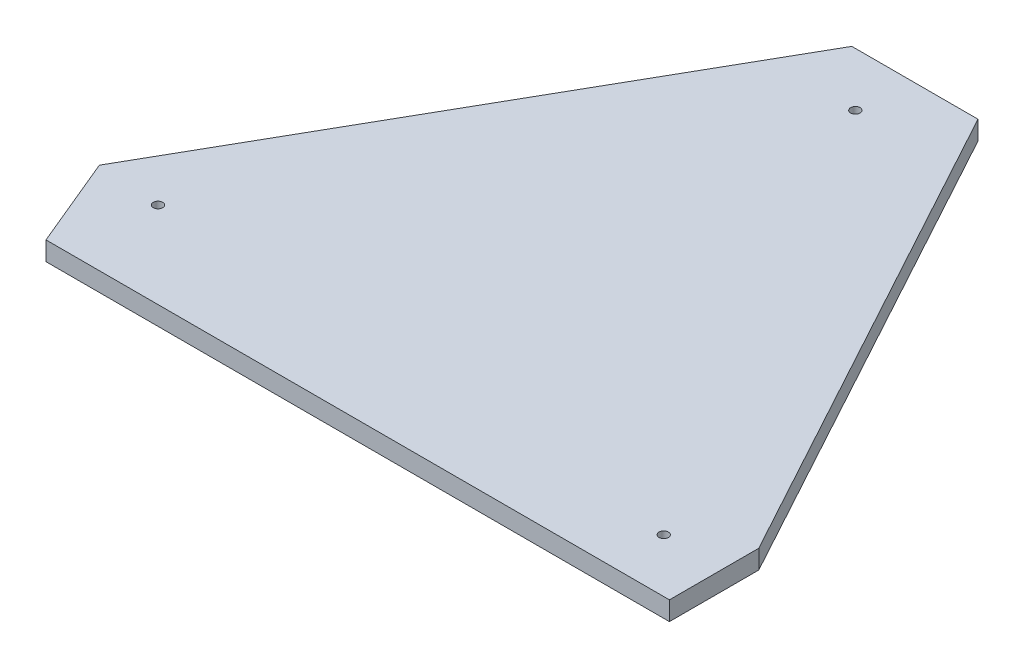
ISO-10303-21;
HEADER;
FILE_DESCRIPTION(('STEP AP214'),'2;1');
FILE_NAME('part.step','',(''),(''),'','','');
FILE_SCHEMA(('AUTOMOTIVE_DESIGN { 1 0 10303 214 1 1 1 1 }'));
ENDSEC;
DATA;
#1=APPLICATION_CONTEXT('core data for automotive mechanical design processes');
#2=APPLICATION_PROTOCOL_DEFINITION('international standard','automotive_design',2000,#1);
#3=PRODUCT_CONTEXT('',#1,'mechanical');
#4=PRODUCT('Part','Part','',(#3));
#5=PRODUCT_RELATED_PRODUCT_CATEGORY('part','',(#4));
#6=PRODUCT_DEFINITION_FORMATION('','',#4);
#7=PRODUCT_DEFINITION_CONTEXT('part definition',#1,'design');
#8=PRODUCT_DEFINITION('design','',#6,#7);
#9=PRODUCT_DEFINITION_SHAPE('','',#8);
#10=(LENGTH_UNIT() NAMED_UNIT(*) SI_UNIT(.MILLI.,.METRE.));
#11=(NAMED_UNIT(*) PLANE_ANGLE_UNIT() SI_UNIT($,.RADIAN.));
#12=(NAMED_UNIT(*) SI_UNIT($,.STERADIAN.) SOLID_ANGLE_UNIT());
#13=UNCERTAINTY_MEASURE_WITH_UNIT(LENGTH_MEASURE(1.E-05),#10,'distance_accuracy_value','');
#14=(GEOMETRIC_REPRESENTATION_CONTEXT(3) GLOBAL_UNCERTAINTY_ASSIGNED_CONTEXT((#13)) GLOBAL_UNIT_ASSIGNED_CONTEXT((#10,
#11,#12)) REPRESENTATION_CONTEXT('',''));
#15=CARTESIAN_POINT('',(0.,0.,0.));
#16=DIRECTION('',(0.,0.,1.));
#17=DIRECTION('',(1.,0.,0.));
#18=AXIS2_PLACEMENT_3D('',#15,#16,#17);
#19=CARTESIAN_POINT('',(0.,15.875,-75.0824));
#20=DIRECTION('',(-1.,0.,0.));
#21=DIRECTION('',(0.,0.,1.));
#22=AXIS2_PLACEMENT_3D('',#19,#20,#21);
#23=PLANE('',#22);
#24=DIRECTION('',(0.,0.,-1.));
#25=VECTOR('',#24,1.);
#26=CARTESIAN_POINT('',(0.,0.,-75.0824));
#27=LINE('',#26,#25);
#28=CARTESIAN_POINT('',(0.,0.,0.));
#29=VERTEX_POINT('',#28);
#30=CARTESIAN_POINT('',(0.,0.,-75.0824));
#31=VERTEX_POINT('',#30);
#32=EDGE_CURVE('E127',#29,#31,#27,.T.);
#33=ORIENTED_EDGE('',*,*,#32,.T.);
#34=DIRECTION('',(0.,-1.,0.));
#35=VECTOR('',#34,1.);
#36=CARTESIAN_POINT('',(0.,15.875,-75.0824));
#37=LINE('',#36,#35);
#38=CARTESIAN_POINT('',(0.,15.875,-75.0824));
#39=VERTEX_POINT('',#38);
#40=EDGE_CURVE('E11',#39,#31,#37,.T.);
#41=ORIENTED_EDGE('',*,*,#40,.F.);
#42=DIRECTION('',(0.,0.,-1.));
#43=VECTOR('',#42,1.);
#44=CARTESIAN_POINT('',(0.,15.875,-75.0824));
#45=LINE('',#44,#43);
#46=CARTESIAN_POINT('',(0.,15.875,0.));
#47=VERTEX_POINT('',#46);
#48=EDGE_CURVE('E144',#47,#39,#45,.T.);
#49=ORIENTED_EDGE('',*,*,#48,.F.);
#50=DIRECTION('',(0.,-1.,0.));
#51=VECTOR('',#50,1.);
#52=CARTESIAN_POINT('',(0.,15.875,0.));
#53=LINE('',#52,#51);
#54=EDGE_CURVE('E123',#47,#29,#53,.T.);
#55=ORIENTED_EDGE('',*,*,#54,.T.);
#56=EDGE_LOOP('',(#33,#41,#49,#55));
#57=FACE_BOUND('',#56,.T.);
#58=ADVANCED_FACE('F38',(#57),#23,.F.);
#59=CARTESIAN_POINT('',(-220.118609958904,15.875,-479.425));
#60=DIRECTION('',(-0.878289655172414,0.,0.478128938276196));
#61=DIRECTION('',(0.478128938276196,0.,0.878289655172414));
#62=AXIS2_PLACEMENT_3D('',#59,#60,#61);
#63=PLANE('',#62);
#64=DIRECTION('',(-0.478128938276196,0.,-0.878289655172414));
#65=VECTOR('',#64,1.);
#66=CARTESIAN_POINT('',(-220.118609958904,0.,-479.425));
#67=LINE('',#66,#65);
#68=CARTESIAN_POINT('',(-220.118609958904,0.,-479.425));
#69=VERTEX_POINT('',#68);
#70=EDGE_CURVE('E131',#31,#69,#67,.T.);
#71=ORIENTED_EDGE('',*,*,#70,.T.);
#72=DIRECTION('',(0.,-1.,0.));
#73=VECTOR('',#72,1.);
#74=CARTESIAN_POINT('',(-220.118609958904,15.875,-479.425));
#75=LINE('',#74,#73);
#76=CARTESIAN_POINT('',(-220.118609958904,15.875,-479.425));
#77=VERTEX_POINT('',#76);
#78=EDGE_CURVE('E47',#77,#69,#75,.T.);
#79=ORIENTED_EDGE('',*,*,#78,.F.);
#80=DIRECTION('',(-0.478128938276196,0.,-0.878289655172414));
#81=VECTOR('',#80,1.);
#82=CARTESIAN_POINT('',(-220.118609958904,15.875,-479.425));
#83=LINE('',#82,#81);
#84=EDGE_CURVE('E92',#39,#77,#83,.T.);
#85=ORIENTED_EDGE('',*,*,#84,.F.);
#86=ORIENTED_EDGE('',*,*,#40,.T.);
#87=EDGE_LOOP('',(#71,#79,#85,#86));
#88=FACE_BOUND('',#87,.T.);
#89=ADVANCED_FACE('F174',(#88),#63,.F.);
#90=CARTESIAN_POINT('',(-326.138209958904,15.875,-479.425));
#91=DIRECTION('',(0.,0.,1.));
#92=DIRECTION('',(1.,0.,0.));
#93=AXIS2_PLACEMENT_3D('',#90,#91,#92);
#94=PLANE('',#93);
#95=DIRECTION('',(-1.,0.,0.));
#96=VECTOR('',#95,1.);
#97=CARTESIAN_POINT('',(-326.138209958904,0.,-479.425));
#98=LINE('',#97,#96);
#99=CARTESIAN_POINT('',(-326.138209958904,0.,-479.425));
#100=VERTEX_POINT('',#99);
#101=EDGE_CURVE('E135',#69,#100,#98,.T.);
#102=ORIENTED_EDGE('',*,*,#101,.T.);
#103=DIRECTION('',(0.,-1.,0.));
#104=VECTOR('',#103,1.);
#105=CARTESIAN_POINT('',(-326.138209958904,15.875,-479.425));
#106=LINE('',#105,#104);
#107=CARTESIAN_POINT('',(-326.138209958904,15.875,-479.425));
#108=VERTEX_POINT('',#107);
#109=EDGE_CURVE('E116',#108,#100,#106,.T.);
#110=ORIENTED_EDGE('',*,*,#109,.F.);
#111=DIRECTION('',(-1.,0.,0.));
#112=VECTOR('',#111,1.);
#113=CARTESIAN_POINT('',(-326.138209958904,15.875,-479.425));
#114=LINE('',#113,#112);
#115=EDGE_CURVE('E105',#77,#108,#114,.T.);
#116=ORIENTED_EDGE('',*,*,#115,.F.);
#117=ORIENTED_EDGE('',*,*,#78,.T.);
#118=EDGE_LOOP('',(#102,#110,#116,#117));
#119=FACE_BOUND('',#118,.T.);
#120=ADVANCED_FACE('F154',(#119),#94,.F.);
#121=CARTESIAN_POINT('',(-555.849378123616,15.875,-76.7944227701986));
#122=DIRECTION('',(0.868580686505882,0.,0.495547768665112));
#123=DIRECTION('',(0.495547768665112,0.,-0.868580686505882));
#124=AXIS2_PLACEMENT_3D('',#121,#122,#123);
#125=PLANE('',#124);
#126=DIRECTION('',(-0.495547768665112,0.,0.868580686505882));
#127=VECTOR('',#126,1.);
#128=CARTESIAN_POINT('',(-555.849378123616,0.,-76.7944227701986));
#129=LINE('',#128,#127);
#130=CARTESIAN_POINT('',(-555.849378123616,0.,-76.7944227701986));
#131=VERTEX_POINT('',#130);
#132=EDGE_CURVE('E114',#100,#131,#129,.T.);
#133=ORIENTED_EDGE('',*,*,#132,.T.);
#134=DIRECTION('',(0.,-1.,0.));
#135=VECTOR('',#134,1.);
#136=CARTESIAN_POINT('',(-555.849378123616,15.875,-76.7944227701986));
#137=LINE('',#136,#135);
#138=CARTESIAN_POINT('',(-555.849378123616,15.875,-76.7944227701986));
#139=VERTEX_POINT('',#138);
#140=EDGE_CURVE('E111',#139,#131,#137,.T.);
#141=ORIENTED_EDGE('',*,*,#140,.F.);
#142=DIRECTION('',(-0.495547768665112,0.,0.868580686505882));
#143=VECTOR('',#142,1.);
#144=CARTESIAN_POINT('',(-555.849378123616,15.875,-76.7944227701986));
#145=LINE('',#144,#143);
#146=EDGE_CURVE('E99',#108,#139,#145,.T.);
#147=ORIENTED_EDGE('',*,*,#146,.F.);
#148=ORIENTED_EDGE('',*,*,#109,.T.);
#149=EDGE_LOOP('',(#133,#141,#147,#148));
#150=FACE_BOUND('',#149,.T.);
#151=ADVANCED_FACE('F112',(#150),#125,.F.);
#152=CARTESIAN_POINT('',(-523.875,15.875,0.));
#153=DIRECTION('',(0.92317632710463,0.,-0.384376728059342));
#154=DIRECTION('',(-0.384376728059342,0.,-0.92317632710463));
#155=AXIS2_PLACEMENT_3D('',#152,#153,#154);
#156=PLANE('',#155);
#157=DIRECTION('',(0.384376728059342,0.,0.92317632710463));
#158=VECTOR('',#157,1.);
#159=CARTESIAN_POINT('',(-523.875,0.,0.));
#160=LINE('',#159,#158);
#161=CARTESIAN_POINT('',(-523.875,0.,0.));
#162=VERTEX_POINT('',#161);
#163=EDGE_CURVE('E78',#131,#162,#160,.T.);
#164=ORIENTED_EDGE('',*,*,#163,.T.);
#165=DIRECTION('',(0.,-1.,0.));
#166=VECTOR('',#165,1.);
#167=CARTESIAN_POINT('',(-523.875,15.875,0.));
#168=LINE('',#167,#166);
#169=CARTESIAN_POINT('',(-523.875,15.875,0.));
#170=VERTEX_POINT('',#169);
#171=EDGE_CURVE('E117',#170,#162,#168,.T.);
#172=ORIENTED_EDGE('',*,*,#171,.F.);
#173=DIRECTION('',(0.384376728059342,0.,0.92317632710463));
#174=VECTOR('',#173,1.);
#175=CARTESIAN_POINT('',(-523.875,15.875,0.));
#176=LINE('',#175,#174);
#177=EDGE_CURVE('E103',#139,#170,#176,.T.);
#178=ORIENTED_EDGE('',*,*,#177,.F.);
#179=ORIENTED_EDGE('',*,*,#140,.T.);
#180=EDGE_LOOP('',(#164,#172,#178,#179));
#181=FACE_BOUND('',#180,.T.);
#182=ADVANCED_FACE('F119',(#181),#156,.F.);
#183=CARTESIAN_POINT('',(0.,15.875,0.));
#184=DIRECTION('',(0.,0.,-1.));
#185=DIRECTION('',(-1.,0.,0.));
#186=AXIS2_PLACEMENT_3D('',#183,#184,#185);
#187=PLANE('',#186);
#188=DIRECTION('',(1.,0.,0.));
#189=VECTOR('',#188,1.);
#190=CARTESIAN_POINT('',(0.,0.,0.));
#191=LINE('',#190,#189);
#192=EDGE_CURVE('E84',#162,#29,#191,.T.);
#193=ORIENTED_EDGE('',*,*,#192,.T.);
#194=ORIENTED_EDGE('',*,*,#54,.F.);
#195=DIRECTION('',(1.,0.,0.));
#196=VECTOR('',#195,1.);
#197=CARTESIAN_POINT('',(0.,15.875,0.));
#198=LINE('',#197,#196);
#199=EDGE_CURVE('E55',#170,#47,#198,.T.);
#200=ORIENTED_EDGE('',*,*,#199,.F.);
#201=ORIENTED_EDGE('',*,*,#171,.T.);
#202=EDGE_LOOP('',(#193,#194,#200,#201));
#203=FACE_BOUND('',#202,.T.);
#204=ADVANCED_FACE('F161',(#203),#187,.F.);
#205=CARTESIAN_POINT('',(0.,15.875,0.));
#206=DIRECTION('',(0.,-1.,0.));
#207=DIRECTION('',(0.,0.,-1.));
#208=AXIS2_PLACEMENT_3D('',#205,#206,#207);
#209=PLANE('',#208);
#210=CARTESIAN_POINT('',(-278.106809958904,15.875,-434.34));
#211=DIRECTION('',(0.,1.,0.));
#212=DIRECTION('',(0.,0.,1.));
#213=AXIS2_PLACEMENT_3D('',#210,#211,#212);
#214=CIRCLE('',#213,3.96875000000005);
#215=CARTESIAN_POINT('',(-278.106809958904,15.875,-430.37125));
#216=VERTEX_POINT('',#215);
#217=EDGE_CURVE('E244',#216,#216,#214,.T.);
#218=ORIENTED_EDGE('',*,*,#217,.F.);
#219=EDGE_LOOP('',(#218));
#220=FACE_BOUND('',#219,.T.);
#221=CARTESIAN_POINT('',(-502.204578123616,15.875,-72.4407999999999));
#222=DIRECTION('',(0.,1.,0.));
#223=DIRECTION('',(0.,0.,1.));
#224=AXIS2_PLACEMENT_3D('',#221,#222,#223);
#225=CIRCLE('',#224,3.96875000000005);
#226=CARTESIAN_POINT('',(-502.204578123616,15.875,-68.4720499999999));
#227=VERTEX_POINT('',#226);
#228=EDGE_CURVE('E252',#227,#227,#225,.T.);
#229=ORIENTED_EDGE('',*,*,#228,.F.);
#230=EDGE_LOOP('',(#229));
#231=FACE_BOUND('',#230,.T.);
#232=CARTESIAN_POINT('',(-49.7332,15.875,-44.9325999999999));
#233=DIRECTION('',(0.,1.,0.));
#234=DIRECTION('',(0.,0.,1.));
#235=AXIS2_PLACEMENT_3D('',#232,#233,#234);
#236=CIRCLE('',#235,3.96874999999998);
#237=CARTESIAN_POINT('',(-49.7332,15.875,-40.96385));
#238=VERTEX_POINT('',#237);
#239=EDGE_CURVE('E262',#238,#238,#236,.T.);
#240=ORIENTED_EDGE('',*,*,#239,.F.);
#241=EDGE_LOOP('',(#240));
#242=FACE_BOUND('',#241,.T.);
#243=ORIENTED_EDGE('',*,*,#48,.T.);
#244=ORIENTED_EDGE('',*,*,#84,.T.);
#245=ORIENTED_EDGE('',*,*,#115,.T.);
#246=ORIENTED_EDGE('',*,*,#146,.T.);
#247=ORIENTED_EDGE('',*,*,#177,.T.);
#248=ORIENTED_EDGE('',*,*,#199,.T.);
#249=EDGE_LOOP('',(#243,#244,#245,#246,#247,#248));
#250=FACE_BOUND('',#249,.T.);
#251=ADVANCED_FACE('F101',(#220,#231,#242,#250),#209,.F.);
#252=CARTESIAN_POINT('',(0.,0.,0.));
#253=DIRECTION('',(0.,-1.,0.));
#254=DIRECTION('',(0.,0.,-1.));
#255=AXIS2_PLACEMENT_3D('',#252,#253,#254);
#256=PLANE('',#255);
#257=CARTESIAN_POINT('',(-278.106809958904,0.,-434.34));
#258=DIRECTION('',(0.,1.,0.));
#259=DIRECTION('',(0.,0.,1.));
#260=AXIS2_PLACEMENT_3D('',#257,#258,#259);
#261=CIRCLE('',#260,3.96875000000005);
#262=CARTESIAN_POINT('',(-278.106809958904,0.,-430.37125));
#263=VERTEX_POINT('',#262);
#264=EDGE_CURVE('E132',#263,#263,#261,.T.);
#265=ORIENTED_EDGE('',*,*,#264,.T.);
#266=EDGE_LOOP('',(#265));
#267=FACE_BOUND('',#266,.T.);
#268=CARTESIAN_POINT('',(-502.204578123616,0.,-72.4407999999999));
#269=DIRECTION('',(0.,1.,0.));
#270=DIRECTION('',(0.,0.,1.));
#271=AXIS2_PLACEMENT_3D('',#268,#269,#270);
#272=CIRCLE('',#271,3.96875000000005);
#273=CARTESIAN_POINT('',(-502.204578123616,0.,-68.4720499999999));
#274=VERTEX_POINT('',#273);
#275=EDGE_CURVE('E246',#274,#274,#272,.T.);
#276=ORIENTED_EDGE('',*,*,#275,.T.);
#277=EDGE_LOOP('',(#276));
#278=FACE_BOUND('',#277,.T.);
#279=CARTESIAN_POINT('',(-49.7332,0.,-44.9325999999999));
#280=DIRECTION('',(0.,1.,0.));
#281=DIRECTION('',(0.,0.,1.));
#282=AXIS2_PLACEMENT_3D('',#279,#280,#281);
#283=CIRCLE('',#282,3.96874999999998);
#284=CARTESIAN_POINT('',(-49.7332,0.,-40.96385));
#285=VERTEX_POINT('',#284);
#286=EDGE_CURVE('E258',#285,#285,#283,.T.);
#287=ORIENTED_EDGE('',*,*,#286,.T.);
#288=EDGE_LOOP('',(#287));
#289=FACE_BOUND('',#288,.T.);
#290=ORIENTED_EDGE('',*,*,#32,.F.);
#291=ORIENTED_EDGE('',*,*,#192,.F.);
#292=ORIENTED_EDGE('',*,*,#163,.F.);
#293=ORIENTED_EDGE('',*,*,#132,.F.);
#294=ORIENTED_EDGE('',*,*,#101,.F.);
#295=ORIENTED_EDGE('',*,*,#70,.F.);
#296=EDGE_LOOP('',(#290,#291,#292,#293,#294,#295));
#297=FACE_BOUND('',#296,.T.);
#298=ADVANCED_FACE('F157',(#267,#278,#289,#297),#256,.T.);
#299=CARTESIAN_POINT('',(-49.7332,0.,-44.9325999999999));
#300=DIRECTION('',(0.,1.,0.));
#301=DIRECTION('',(0.,0.,1.));
#302=AXIS2_PLACEMENT_3D('',#299,#300,#301);
#303=CYLINDRICAL_SURFACE('',#302,3.96874999999998);
#304=ORIENTED_EDGE('',*,*,#286,.F.);
#305=EDGE_LOOP('',(#304));
#306=FACE_BOUND('',#305,.T.);
#307=ORIENTED_EDGE('',*,*,#239,.T.);
#308=EDGE_LOOP('',(#307));
#309=FACE_BOUND('',#308,.T.);
#310=ADVANCED_FACE('F207',(#306,#309),#303,.F.);
#311=CARTESIAN_POINT('',(-502.204578123616,0.,-72.4407999999999));
#312=DIRECTION('',(0.,1.,0.));
#313=DIRECTION('',(0.,0.,1.));
#314=AXIS2_PLACEMENT_3D('',#311,#312,#313);
#315=CYLINDRICAL_SURFACE('',#314,3.96875000000005);
#316=ORIENTED_EDGE('',*,*,#275,.F.);
#317=EDGE_LOOP('',(#316));
#318=FACE_BOUND('',#317,.T.);
#319=ORIENTED_EDGE('',*,*,#228,.T.);
#320=EDGE_LOOP('',(#319));
#321=FACE_BOUND('',#320,.T.);
#322=ADVANCED_FACE('F215',(#318,#321),#315,.F.);
#323=CARTESIAN_POINT('',(-278.106809958904,0.,-434.34));
#324=DIRECTION('',(0.,1.,0.));
#325=DIRECTION('',(0.,0.,1.));
#326=AXIS2_PLACEMENT_3D('',#323,#324,#325);
#327=CYLINDRICAL_SURFACE('',#326,3.96875000000005);
#328=ORIENTED_EDGE('',*,*,#264,.F.);
#329=EDGE_LOOP('',(#328));
#330=FACE_BOUND('',#329,.T.);
#331=ORIENTED_EDGE('',*,*,#217,.T.);
#332=EDGE_LOOP('',(#331));
#333=FACE_BOUND('',#332,.T.);
#334=ADVANCED_FACE('F225',(#330,#333),#327,.F.);
#335=CLOSED_SHELL('',(#58,#89,#120,#151,#182,#204,#251,#298,#310,#322,#334));
#336=MANIFOLD_SOLID_BREP('B2',#335);
#337=ADVANCED_BREP_SHAPE_REPRESENTATION('',(#18,#336),#14);
#338=SHAPE_DEFINITION_REPRESENTATION(#9,#337);
ENDSEC;
END-ISO-10303-21;
